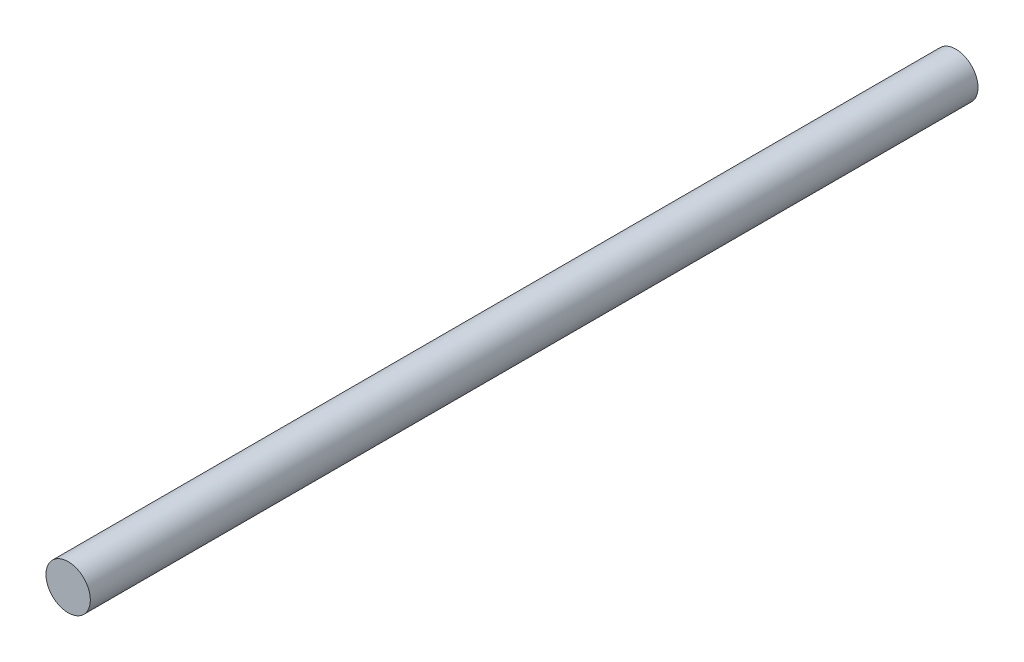
ISO-10303-21;
HEADER;
FILE_DESCRIPTION(('STEP AP214'),'2;1');
FILE_NAME('part.step','',(''),(''),'','','');
FILE_SCHEMA(('AUTOMOTIVE_DESIGN { 1 0 10303 214 1 1 1 1 }'));
ENDSEC;
DATA;
#1=APPLICATION_CONTEXT('core data for automotive mechanical design processes');
#2=APPLICATION_PROTOCOL_DEFINITION('international standard','automotive_design',2000,#1);
#3=PRODUCT_CONTEXT('',#1,'mechanical');
#4=PRODUCT('Part','Part','',(#3));
#5=PRODUCT_RELATED_PRODUCT_CATEGORY('part','',(#4));
#6=PRODUCT_DEFINITION_FORMATION('','',#4);
#7=PRODUCT_DEFINITION_CONTEXT('part definition',#1,'design');
#8=PRODUCT_DEFINITION('design','',#6,#7);
#9=PRODUCT_DEFINITION_SHAPE('','',#8);
#10=(LENGTH_UNIT() NAMED_UNIT(*) SI_UNIT(.MILLI.,.METRE.));
#11=(NAMED_UNIT(*) PLANE_ANGLE_UNIT() SI_UNIT($,.RADIAN.));
#12=(NAMED_UNIT(*) SI_UNIT($,.STERADIAN.) SOLID_ANGLE_UNIT());
#13=UNCERTAINTY_MEASURE_WITH_UNIT(LENGTH_MEASURE(1.E-05),#10,'distance_accuracy_value','');
#14=(GEOMETRIC_REPRESENTATION_CONTEXT(3) GLOBAL_UNCERTAINTY_ASSIGNED_CONTEXT((#13)) GLOBAL_UNIT_ASSIGNED_CONTEXT((#10,
#11,#12)) REPRESENTATION_CONTEXT('',''));
#15=CARTESIAN_POINT('',(0.,0.,0.));
#16=DIRECTION('',(0.,0.,1.));
#17=DIRECTION('',(1.,0.,0.));
#18=AXIS2_PLACEMENT_3D('',#15,#16,#17);
#19=CARTESIAN_POINT('',(0.,0.,254.));
#20=DIRECTION('',(0.,0.,-1.));
#21=DIRECTION('',(-1.,0.,0.));
#22=AXIS2_PLACEMENT_3D('',#19,#20,#21);
#23=CYLINDRICAL_SURFACE('',#22,6.35);
#24=CARTESIAN_POINT('',(0.,0.,254.));
#25=DIRECTION('',(0.,0.,1.));
#26=DIRECTION('',(1.,0.,0.));
#27=AXIS2_PLACEMENT_3D('',#24,#25,#26);
#28=CIRCLE('',#27,6.35);
#29=CARTESIAN_POINT('',(6.35,0.,254.));
#30=VERTEX_POINT('',#29);
#31=EDGE_CURVE('E10',#30,#30,#28,.T.);
#32=ORIENTED_EDGE('',*,*,#31,.F.);
#33=EDGE_LOOP('',(#32));
#34=FACE_BOUND('',#33,.T.);
#35=CARTESIAN_POINT('',(0.,0.,0.));
#36=DIRECTION('',(0.,0.,1.));
#37=DIRECTION('',(1.,0.,0.));
#38=AXIS2_PLACEMENT_3D('',#35,#36,#37);
#39=CIRCLE('',#38,6.35);
#40=CARTESIAN_POINT('',(6.35,0.,0.));
#41=VERTEX_POINT('',#40);
#42=EDGE_CURVE('E34',#41,#41,#39,.T.);
#43=ORIENTED_EDGE('',*,*,#42,.T.);
#44=EDGE_LOOP('',(#43));
#45=FACE_BOUND('',#44,.T.);
#46=ADVANCED_FACE('F31',(#34,#45),#23,.T.);
#47=CARTESIAN_POINT('',(0.,0.,254.));
#48=DIRECTION('',(0.,0.,1.));
#49=DIRECTION('',(1.,0.,0.));
#50=AXIS2_PLACEMENT_3D('',#47,#48,#49);
#51=PLANE('',#50);
#52=ORIENTED_EDGE('',*,*,#31,.T.);
#53=EDGE_LOOP('',(#52));
#54=FACE_BOUND('',#53,.T.);
#55=ADVANCED_FACE('F46',(#54),#51,.T.);
#56=CARTESIAN_POINT('',(0.,0.,0.));
#57=DIRECTION('',(0.,0.,1.));
#58=DIRECTION('',(1.,0.,0.));
#59=AXIS2_PLACEMENT_3D('',#56,#57,#58);
#60=PLANE('',#59);
#61=ORIENTED_EDGE('',*,*,#42,.F.);
#62=EDGE_LOOP('',(#61));
#63=FACE_BOUND('',#62,.T.);
#64=ADVANCED_FACE('F44',(#63),#60,.F.);
#65=CLOSED_SHELL('',(#46,#55,#64));
#66=MANIFOLD_SOLID_BREP('B2',#65);
#67=ADVANCED_BREP_SHAPE_REPRESENTATION('',(#18,#66),#14);
#68=SHAPE_DEFINITION_REPRESENTATION(#9,#67);
ENDSEC;
END-ISO-10303-21;
